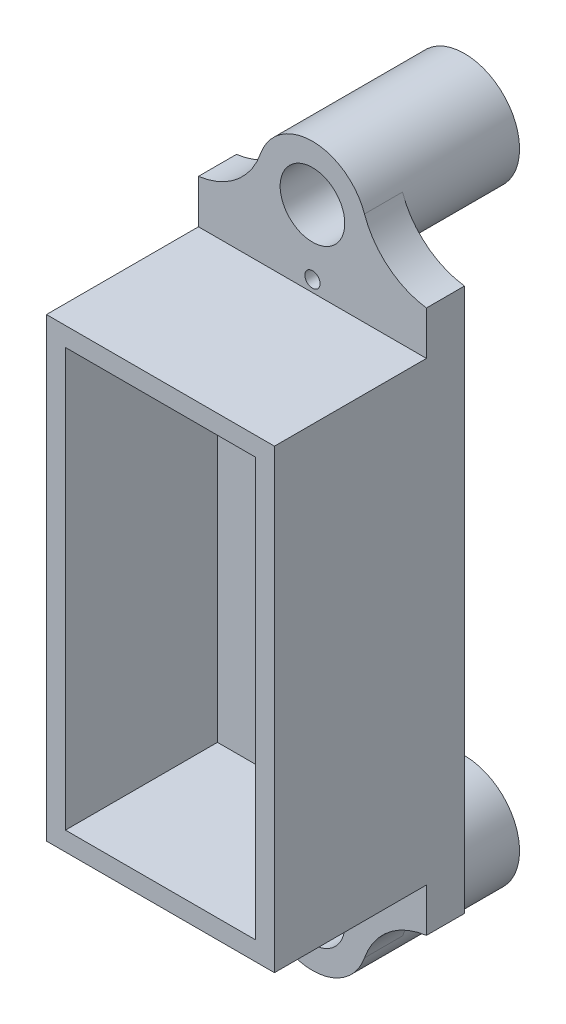
ISO-10303-21;
HEADER;
FILE_DESCRIPTION(('STEP AP214'),'2;1');
FILE_NAME('part.step','',(''),(''),'','','');
FILE_SCHEMA(('AUTOMOTIVE_DESIGN { 1 0 10303 214 1 1 1 1 }'));
ENDSEC;
DATA;
#1=APPLICATION_CONTEXT('core data for automotive mechanical design processes');
#2=APPLICATION_PROTOCOL_DEFINITION('international standard','automotive_design',2000,#1);
#3=PRODUCT_CONTEXT('',#1,'mechanical');
#4=PRODUCT('Part','Part','',(#3));
#5=PRODUCT_RELATED_PRODUCT_CATEGORY('part','',(#4));
#6=PRODUCT_DEFINITION_FORMATION('','',#4);
#7=PRODUCT_DEFINITION_CONTEXT('part definition',#1,'design');
#8=PRODUCT_DEFINITION('design','',#6,#7);
#9=PRODUCT_DEFINITION_SHAPE('','',#8);
#10=(LENGTH_UNIT() NAMED_UNIT(*) SI_UNIT(.MILLI.,.METRE.));
#11=(NAMED_UNIT(*) PLANE_ANGLE_UNIT() SI_UNIT($,.RADIAN.));
#12=(NAMED_UNIT(*) SI_UNIT($,.STERADIAN.) SOLID_ANGLE_UNIT());
#13=UNCERTAINTY_MEASURE_WITH_UNIT(LENGTH_MEASURE(1.E-05),#10,'distance_accuracy_value','');
#14=(GEOMETRIC_REPRESENTATION_CONTEXT(3) GLOBAL_UNCERTAINTY_ASSIGNED_CONTEXT((#13)) GLOBAL_UNIT_ASSIGNED_CONTEXT((#10,
#11,#12)) REPRESENTATION_CONTEXT('',''));
#15=CARTESIAN_POINT('',(0.,0.,0.));
#16=DIRECTION('',(0.,0.,1.));
#17=DIRECTION('',(1.,0.,0.));
#18=AXIS2_PLACEMENT_3D('',#15,#16,#17);
#19=CARTESIAN_POINT('',(0.,40.,20.));
#20=DIRECTION('',(0.,0.,1.));
#21=DIRECTION('',(1.,0.,0.));
#22=AXIS2_PLACEMENT_3D('',#19,#20,#21);
#23=PLANE('',#22);
#24=CARTESIAN_POINT('',(0.,-31.5,20.));
#25=DIRECTION('',(0.,0.,1.));
#26=DIRECTION('',(-1.,0.,0.));
#27=AXIS2_PLACEMENT_3D('',#24,#25,#26);
#28=CIRCLE('',#27,1.);
#29=CARTESIAN_POINT('',(-1.,-31.5,20.));
#30=VERTEX_POINT('',#29);
#31=EDGE_CURVE('E299',#30,#30,#28,.T.);
#32=ORIENTED_EDGE('',*,*,#31,.F.);
#33=EDGE_LOOP('',(#32));
#34=FACE_BOUND('',#33,.T.);
#35=DIRECTION('',(1.,0.,0.));
#36=VECTOR('',#35,1.);
#37=CARTESIAN_POINT('',(-15.,-30.,20.));
#38=LINE('',#37,#36);
#39=CARTESIAN_POINT('',(-15.,-30.,20.));
#40=VERTEX_POINT('',#39);
#41=CARTESIAN_POINT('',(15.,-30.,20.));
#42=VERTEX_POINT('',#41);
#43=EDGE_CURVE('E194',#40,#42,#38,.T.);
#44=ORIENTED_EDGE('',*,*,#43,.F.);
#45=DIRECTION('',(0.,-1.,0.));
#46=VECTOR('',#45,1.);
#47=CARTESIAN_POINT('',(-15.,-35.75,20.));
#48=LINE('',#47,#46);
#49=CARTESIAN_POINT('',(-15.,-35.75,20.));
#50=VERTEX_POINT('',#49);
#51=EDGE_CURVE('E238',#40,#50,#48,.T.);
#52=ORIENTED_EDGE('',*,*,#51,.T.);
#53=CARTESIAN_POINT('',(-16.2928865034887,-45.6660700123132,20.));
#54=DIRECTION('',(0.,0.,1.));
#55=DIRECTION('',(1.,0.,0.));
#56=AXIS2_PLACEMENT_3D('',#53,#54,#55);
#57=CIRCLE('',#56,10.);
#58=CARTESIAN_POINT('',(-6.84773490726338,-42.3813917443055,20.));
#59=VERTEX_POINT('',#58);
#60=EDGE_CURVE('E278',#50,#59,#57,.F.);
#61=ORIENTED_EDGE('',*,*,#60,.T.);
#62=CARTESIAN_POINT('',(0.,-40.,20.));
#63=DIRECTION('',(0.,0.,1.));
#64=DIRECTION('',(-1.,0.,0.));
#65=AXIS2_PLACEMENT_3D('',#62,#63,#64);
#66=CIRCLE('',#65,7.25);
#67=CARTESIAN_POINT('',(6.84773490726338,-42.3813917443055,20.));
#68=VERTEX_POINT('',#67);
#69=EDGE_CURVE('E222',#59,#68,#66,.T.);
#70=ORIENTED_EDGE('',*,*,#69,.T.);
#71=CARTESIAN_POINT('',(16.2928865034887,-45.6660700123132,20.));
#72=DIRECTION('',(0.,0.,1.));
#73=DIRECTION('',(1.,0.,0.));
#74=AXIS2_PLACEMENT_3D('',#71,#72,#73);
#75=CIRCLE('',#74,10.);
#76=CARTESIAN_POINT('',(15.,-35.75,20.));
#77=VERTEX_POINT('',#76);
#78=EDGE_CURVE('E285',#68,#77,#75,.F.);
#79=ORIENTED_EDGE('',*,*,#78,.T.);
#80=DIRECTION('',(0.,1.,0.));
#81=VECTOR('',#80,1.);
#82=CARTESIAN_POINT('',(15.,-35.75,20.));
#83=LINE('',#82,#81);
#84=EDGE_CURVE('E236',#77,#42,#83,.T.);
#85=ORIENTED_EDGE('',*,*,#84,.T.);
#86=EDGE_LOOP('',(#44,#52,#61,#70,#79,#85));
#87=FACE_BOUND('',#86,.T.);
#88=CARTESIAN_POINT('',(0.,-40.,20.));
#89=DIRECTION('',(0.,0.,1.));
#90=DIRECTION('',(-1.,0.,0.));
#91=AXIS2_PLACEMENT_3D('',#88,#89,#90);
#92=CIRCLE('',#91,4.25);
#93=CARTESIAN_POINT('',(-4.25,-40.,20.));
#94=VERTEX_POINT('',#93);
#95=EDGE_CURVE('E216',#94,#94,#92,.T.);
#96=ORIENTED_EDGE('',*,*,#95,.F.);
#97=EDGE_LOOP('',(#96));
#98=FACE_BOUND('',#97,.T.);
#99=ADVANCED_FACE('F33',(#34,#87,#98),#23,.T.);
#100=CARTESIAN_POINT('',(0.,31.5,20.));
#101=DIRECTION('',(0.,0.,1.));
#102=DIRECTION('',(1.,0.,0.));
#103=AXIS2_PLACEMENT_3D('',#100,#101,#102);
#104=CIRCLE('',#103,1.);
#105=CARTESIAN_POINT('',(1.,31.5,20.));
#106=VERTEX_POINT('',#105);
#107=EDGE_CURVE('E292',#106,#106,#104,.T.);
#108=ORIENTED_EDGE('',*,*,#107,.F.);
#109=EDGE_LOOP('',(#108));
#110=FACE_BOUND('',#109,.T.);
#111=DIRECTION('',(-1.,0.,0.));
#112=VECTOR('',#111,1.);
#113=CARTESIAN_POINT('',(-15.,30.,20.));
#114=LINE('',#113,#112);
#115=CARTESIAN_POINT('',(15.,30.,20.));
#116=VERTEX_POINT('',#115);
#117=CARTESIAN_POINT('',(-15.,30.,20.));
#118=VERTEX_POINT('',#117);
#119=EDGE_CURVE('E58',#116,#118,#114,.T.);
#120=ORIENTED_EDGE('',*,*,#119,.F.);
#121=CARTESIAN_POINT('',(15.,35.75,20.));
#122=VERTEX_POINT('',#121);
#123=EDGE_CURVE('E225',#116,#122,#83,.T.);
#124=ORIENTED_EDGE('',*,*,#123,.T.);
#125=CARTESIAN_POINT('',(16.2928865034887,45.6660700123132,20.));
#126=DIRECTION('',(0.,0.,1.));
#127=DIRECTION('',(1.,0.,0.));
#128=AXIS2_PLACEMENT_3D('',#125,#126,#127);
#129=CIRCLE('',#128,10.);
#130=CARTESIAN_POINT('',(6.84773490726338,42.3813917443055,20.));
#131=VERTEX_POINT('',#130);
#132=EDGE_CURVE('E289',#122,#131,#129,.F.);
#133=ORIENTED_EDGE('',*,*,#132,.T.);
#134=CARTESIAN_POINT('',(0.,40.,20.));
#135=DIRECTION('',(0.,0.,1.));
#136=DIRECTION('',(1.,0.,0.));
#137=AXIS2_PLACEMENT_3D('',#134,#135,#136);
#138=CIRCLE('',#137,7.25);
#139=CARTESIAN_POINT('',(-6.84773490726338,42.3813917443055,20.));
#140=VERTEX_POINT('',#139);
#141=EDGE_CURVE('E260',#131,#140,#138,.T.);
#142=ORIENTED_EDGE('',*,*,#141,.T.);
#143=CARTESIAN_POINT('',(-16.2928865034887,45.6660700123132,20.));
#144=DIRECTION('',(0.,0.,1.));
#145=DIRECTION('',(1.,0.,0.));
#146=AXIS2_PLACEMENT_3D('',#143,#144,#145);
#147=CIRCLE('',#146,10.);
#148=CARTESIAN_POINT('',(-15.,35.75,20.));
#149=VERTEX_POINT('',#148);
#150=EDGE_CURVE('E42',#140,#149,#147,.F.);
#151=ORIENTED_EDGE('',*,*,#150,.T.);
#152=EDGE_CURVE('E232',#149,#118,#48,.T.);
#153=ORIENTED_EDGE('',*,*,#152,.T.);
#154=EDGE_LOOP('',(#120,#124,#133,#142,#151,#153));
#155=FACE_BOUND('',#154,.T.);
#156=CARTESIAN_POINT('',(0.,40.,20.));
#157=DIRECTION('',(0.,0.,1.));
#158=DIRECTION('',(1.,0.,0.));
#159=AXIS2_PLACEMENT_3D('',#156,#157,#158);
#160=CIRCLE('',#159,4.25);
#161=CARTESIAN_POINT('',(4.25,40.,20.));
#162=VERTEX_POINT('',#161);
#163=EDGE_CURVE('E254',#162,#162,#160,.T.);
#164=ORIENTED_EDGE('',*,*,#163,.F.);
#165=EDGE_LOOP('',(#164));
#166=FACE_BOUND('',#165,.T.);
#167=ADVANCED_FACE('F308',(#110,#155,#166),#23,.T.);
#168=CARTESIAN_POINT('',(0.,40.,0.));
#169=DIRECTION('',(0.,0.,1.));
#170=DIRECTION('',(1.,0.,0.));
#171=AXIS2_PLACEMENT_3D('',#168,#169,#170);
#172=PLANE('',#171);
#173=CARTESIAN_POINT('',(0.,40.,0.));
#174=DIRECTION('',(0.,0.,1.));
#175=DIRECTION('',(1.,0.,0.));
#176=AXIS2_PLACEMENT_3D('',#173,#174,#175);
#177=CIRCLE('',#176,7.25);
#178=CARTESIAN_POINT('',(7.25,40.,0.));
#179=VERTEX_POINT('',#178);
#180=EDGE_CURVE('E257',#179,#179,#177,.T.);
#181=ORIENTED_EDGE('',*,*,#180,.F.);
#182=EDGE_LOOP('',(#181));
#183=FACE_BOUND('',#182,.T.);
#184=CARTESIAN_POINT('',(0.,40.,0.));
#185=DIRECTION('',(0.,0.,1.));
#186=DIRECTION('',(1.,0.,0.));
#187=AXIS2_PLACEMENT_3D('',#184,#185,#186);
#188=CIRCLE('',#187,4.25);
#189=CARTESIAN_POINT('',(4.25,40.,0.));
#190=VERTEX_POINT('',#189);
#191=EDGE_CURVE('E253',#190,#190,#188,.T.);
#192=ORIENTED_EDGE('',*,*,#191,.T.);
#193=EDGE_LOOP('',(#192));
#194=FACE_BOUND('',#193,.T.);
#195=ADVANCED_FACE('F353',(#183,#194),#172,.F.);
#196=CARTESIAN_POINT('',(0.,40.,20.));
#197=DIRECTION('',(0.,0.,-1.));
#198=DIRECTION('',(-1.,0.,0.));
#199=AXIS2_PLACEMENT_3D('',#196,#197,#198);
#200=CYLINDRICAL_SURFACE('',#199,7.25);
#201=ORIENTED_EDGE('',*,*,#141,.F.);
#202=DIRECTION('',(0.,0.,-1.));
#203=VECTOR('',#202,1.);
#204=CARTESIAN_POINT('',(6.84773490726338,42.3813917443055,20.));
#205=LINE('',#204,#203);
#206=CARTESIAN_POINT('',(6.84773490726338,42.3813917443055,15.));
#207=VERTEX_POINT('',#206);
#208=EDGE_CURVE('E275',#131,#207,#205,.T.);
#209=ORIENTED_EDGE('',*,*,#208,.T.);
#210=CARTESIAN_POINT('',(0.,40.,15.));
#211=DIRECTION('',(0.,0.,-1.));
#212=DIRECTION('',(-1.,0.,0.));
#213=AXIS2_PLACEMENT_3D('',#210,#211,#212);
#214=CIRCLE('',#213,7.25);
#215=CARTESIAN_POINT('',(-6.84773490726338,42.3813917443055,15.));
#216=VERTEX_POINT('',#215);
#217=EDGE_CURVE('E243',#207,#216,#214,.T.);
#218=ORIENTED_EDGE('',*,*,#217,.T.);
#219=DIRECTION('',(0.,0.,-1.));
#220=VECTOR('',#219,1.);
#221=CARTESIAN_POINT('',(-6.84773490726338,42.3813917443055,20.));
#222=LINE('',#221,#220);
#223=EDGE_CURVE('E272',#216,#140,#222,.F.);
#224=ORIENTED_EDGE('',*,*,#223,.T.);
#225=EDGE_LOOP('',(#201,#209,#218,#224));
#226=FACE_BOUND('',#225,.T.);
#227=ORIENTED_EDGE('',*,*,#180,.T.);
#228=EDGE_LOOP('',(#227));
#229=FACE_BOUND('',#228,.T.);
#230=ADVANCED_FACE('F349',(#226,#229),#200,.T.);
#231=CARTESIAN_POINT('',(0.,40.,20.));
#232=DIRECTION('',(0.,0.,-1.));
#233=DIRECTION('',(-1.,0.,0.));
#234=AXIS2_PLACEMENT_3D('',#231,#232,#233);
#235=CYLINDRICAL_SURFACE('',#234,4.25);
#236=ORIENTED_EDGE('',*,*,#163,.T.);
#237=EDGE_LOOP('',(#236));
#238=FACE_BOUND('',#237,.T.);
#239=ORIENTED_EDGE('',*,*,#191,.F.);
#240=EDGE_LOOP('',(#239));
#241=FACE_BOUND('',#240,.T.);
#242=ADVANCED_FACE('F347',(#238,#241),#235,.F.);
#243=CARTESIAN_POINT('',(15.,-35.75,15.));
#244=DIRECTION('',(1.,0.,0.));
#245=DIRECTION('',(0.,0.,-1.));
#246=AXIS2_PLACEMENT_3D('',#243,#244,#245);
#247=PLANE('',#246);
#248=ORIENTED_EDGE('',*,*,#84,.F.);
#249=DIRECTION('',(0.,0.,1.));
#250=VECTOR('',#249,1.);
#251=CARTESIAN_POINT('',(15.,-35.75,15.));
#252=LINE('',#251,#250);
#253=CARTESIAN_POINT('',(15.,-35.75,15.));
#254=VERTEX_POINT('',#253);
#255=EDGE_CURVE('E240',#254,#77,#252,.T.);
#256=ORIENTED_EDGE('',*,*,#255,.F.);
#257=DIRECTION('',(0.,1.,0.));
#258=VECTOR('',#257,1.);
#259=CARTESIAN_POINT('',(15.,-35.75,15.));
#260=LINE('',#259,#258);
#261=CARTESIAN_POINT('',(15.,35.75,15.));
#262=VERTEX_POINT('',#261);
#263=EDGE_CURVE('E228',#254,#262,#260,.T.);
#264=ORIENTED_EDGE('',*,*,#263,.T.);
#265=DIRECTION('',(0.,0.,1.));
#266=VECTOR('',#265,1.);
#267=CARTESIAN_POINT('',(15.,35.75,15.));
#268=LINE('',#267,#266);
#269=EDGE_CURVE('E235',#262,#122,#268,.T.);
#270=ORIENTED_EDGE('',*,*,#269,.T.);
#271=ORIENTED_EDGE('',*,*,#123,.F.);
#272=DIRECTION('',(0.,0.,-1.));
#273=VECTOR('',#272,1.);
#274=CARTESIAN_POINT('',(15.,30.,40.));
#275=LINE('',#274,#273);
#276=CARTESIAN_POINT('',(15.,30.,40.));
#277=VERTEX_POINT('',#276);
#278=EDGE_CURVE('E212',#277,#116,#275,.T.);
#279=ORIENTED_EDGE('',*,*,#278,.F.);
#280=DIRECTION('',(0.,1.,0.));
#281=VECTOR('',#280,1.);
#282=CARTESIAN_POINT('',(15.,-30.,40.));
#283=LINE('',#282,#281);
#284=CARTESIAN_POINT('',(15.,-30.,40.));
#285=VERTEX_POINT('',#284);
#286=EDGE_CURVE('E190',#285,#277,#283,.T.);
#287=ORIENTED_EDGE('',*,*,#286,.F.);
#288=DIRECTION('',(0.,0.,-1.));
#289=VECTOR('',#288,1.);
#290=CARTESIAN_POINT('',(15.,-30.,40.));
#291=LINE('',#290,#289);
#292=EDGE_CURVE('E200',#285,#42,#291,.T.);
#293=ORIENTED_EDGE('',*,*,#292,.T.);
#294=EDGE_LOOP('',(#248,#256,#264,#270,#271,#279,#287,#293));
#295=FACE_BOUND('',#294,.T.);
#296=ADVANCED_FACE('F343',(#295),#247,.T.);
#297=CARTESIAN_POINT('',(-15.,-35.75,15.));
#298=DIRECTION('',(-1.,0.,0.));
#299=DIRECTION('',(0.,0.,1.));
#300=AXIS2_PLACEMENT_3D('',#297,#298,#299);
#301=PLANE('',#300);
#302=ORIENTED_EDGE('',*,*,#152,.F.);
#303=DIRECTION('',(0.,0.,1.));
#304=VECTOR('',#303,1.);
#305=CARTESIAN_POINT('',(-15.,35.75,15.));
#306=LINE('',#305,#304);
#307=CARTESIAN_POINT('',(-15.,35.75,15.));
#308=VERTEX_POINT('',#307);
#309=EDGE_CURVE('E247',#308,#149,#306,.T.);
#310=ORIENTED_EDGE('',*,*,#309,.F.);
#311=DIRECTION('',(0.,-1.,0.));
#312=VECTOR('',#311,1.);
#313=CARTESIAN_POINT('',(-15.,-35.75,15.));
#314=LINE('',#313,#312);
#315=CARTESIAN_POINT('',(-15.,-35.75,15.));
#316=VERTEX_POINT('',#315);
#317=EDGE_CURVE('E231',#308,#316,#314,.T.);
#318=ORIENTED_EDGE('',*,*,#317,.T.);
#319=DIRECTION('',(0.,0.,1.));
#320=VECTOR('',#319,1.);
#321=CARTESIAN_POINT('',(-15.,-35.75,15.));
#322=LINE('',#321,#320);
#323=EDGE_CURVE('E244',#316,#50,#322,.T.);
#324=ORIENTED_EDGE('',*,*,#323,.T.);
#325=ORIENTED_EDGE('',*,*,#51,.F.);
#326=DIRECTION('',(0.,0.,-1.));
#327=VECTOR('',#326,1.);
#328=CARTESIAN_POINT('',(-15.,-30.,40.));
#329=LINE('',#328,#327);
#330=CARTESIAN_POINT('',(-15.,-30.,40.));
#331=VERTEX_POINT('',#330);
#332=EDGE_CURVE('E206',#331,#40,#329,.T.);
#333=ORIENTED_EDGE('',*,*,#332,.F.);
#334=DIRECTION('',(0.,-1.,0.));
#335=VECTOR('',#334,1.);
#336=CARTESIAN_POINT('',(-15.,-30.,40.));
#337=LINE('',#336,#335);
#338=CARTESIAN_POINT('',(-15.,30.,40.));
#339=VERTEX_POINT('',#338);
#340=EDGE_CURVE('E196',#339,#331,#337,.T.);
#341=ORIENTED_EDGE('',*,*,#340,.F.);
#342=DIRECTION('',(0.,0.,-1.));
#343=VECTOR('',#342,1.);
#344=CARTESIAN_POINT('',(-15.,30.,40.));
#345=LINE('',#344,#343);
#346=EDGE_CURVE('E209',#339,#118,#345,.T.);
#347=ORIENTED_EDGE('',*,*,#346,.T.);
#348=EDGE_LOOP('',(#302,#310,#318,#324,#325,#333,#341,#347));
#349=FACE_BOUND('',#348,.T.);
#350=ADVANCED_FACE('F335',(#349),#301,.T.);
#351=CARTESIAN_POINT('',(0.,0.,15.));
#352=DIRECTION('',(0.,0.,-1.));
#353=DIRECTION('',(-1.,0.,0.));
#354=AXIS2_PLACEMENT_3D('',#351,#352,#353);
#355=PLANE('',#354);
#356=CARTESIAN_POINT('',(0.,-31.5,15.));
#357=DIRECTION('',(0.,0.,-1.));
#358=DIRECTION('',(-1.,0.,0.));
#359=AXIS2_PLACEMENT_3D('',#356,#357,#358);
#360=CIRCLE('',#359,1.);
#361=CARTESIAN_POINT('',(-1.,-31.5,15.));
#362=VERTEX_POINT('',#361);
#363=EDGE_CURVE('E37',#362,#362,#360,.T.);
#364=ORIENTED_EDGE('',*,*,#363,.F.);
#365=EDGE_LOOP('',(#364));
#366=FACE_BOUND('',#365,.T.);
#367=CARTESIAN_POINT('',(0.,31.5,15.));
#368=DIRECTION('',(0.,0.,-1.));
#369=DIRECTION('',(-1.,0.,0.));
#370=AXIS2_PLACEMENT_3D('',#367,#368,#369);
#371=CIRCLE('',#370,1.);
#372=CARTESIAN_POINT('',(-1.,31.5,15.));
#373=VERTEX_POINT('',#372);
#374=EDGE_CURVE('E180',#373,#373,#371,.T.);
#375=ORIENTED_EDGE('',*,*,#374,.F.);
#376=EDGE_LOOP('',(#375));
#377=FACE_BOUND('',#376,.T.);
#378=ORIENTED_EDGE('',*,*,#263,.F.);
#379=CARTESIAN_POINT('',(16.2928865034887,-45.6660700123132,15.));
#380=DIRECTION('',(0.,0.,-1.));
#381=DIRECTION('',(-1.,0.,0.));
#382=AXIS2_PLACEMENT_3D('',#379,#380,#381);
#383=CIRCLE('',#382,10.);
#384=CARTESIAN_POINT('',(6.84773490726338,-42.3813917443055,15.));
#385=VERTEX_POINT('',#384);
#386=EDGE_CURVE('E282',#254,#385,#383,.F.);
#387=ORIENTED_EDGE('',*,*,#386,.T.);
#388=CARTESIAN_POINT('',(0.,-40.,15.));
#389=DIRECTION('',(0.,0.,-1.));
#390=DIRECTION('',(-1.,0.,0.));
#391=AXIS2_PLACEMENT_3D('',#388,#389,#390);
#392=CIRCLE('',#391,7.25);
#393=CARTESIAN_POINT('',(-6.84773490726338,-42.3813917443055,15.));
#394=VERTEX_POINT('',#393);
#395=EDGE_CURVE('E263',#385,#394,#392,.F.);
#396=ORIENTED_EDGE('',*,*,#395,.T.);
#397=CARTESIAN_POINT('',(-16.2928865034887,-45.6660700123132,15.));
#398=DIRECTION('',(0.,0.,-1.));
#399=DIRECTION('',(-1.,0.,0.));
#400=AXIS2_PLACEMENT_3D('',#397,#398,#399);
#401=CIRCLE('',#400,10.);
#402=EDGE_CURVE('E280',#394,#316,#401,.F.);
#403=ORIENTED_EDGE('',*,*,#402,.T.);
#404=ORIENTED_EDGE('',*,*,#317,.F.);
#405=CARTESIAN_POINT('',(-16.2928865034887,45.6660700123132,15.));
#406=DIRECTION('',(0.,0.,-1.));
#407=DIRECTION('',(-1.,0.,0.));
#408=AXIS2_PLACEMENT_3D('',#405,#406,#407);
#409=CIRCLE('',#408,10.);
#410=EDGE_CURVE('E11',#308,#216,#409,.F.);
#411=ORIENTED_EDGE('',*,*,#410,.T.);
#412=ORIENTED_EDGE('',*,*,#217,.F.);
#413=CARTESIAN_POINT('',(16.2928865034887,45.6660700123132,15.));
#414=DIRECTION('',(0.,0.,-1.));
#415=DIRECTION('',(-1.,0.,0.));
#416=AXIS2_PLACEMENT_3D('',#413,#414,#415);
#417=CIRCLE('',#416,10.);
#418=EDGE_CURVE('E287',#207,#262,#417,.F.);
#419=ORIENTED_EDGE('',*,*,#418,.T.);
#420=EDGE_LOOP('',(#378,#387,#396,#403,#404,#411,#412,#419));
#421=FACE_BOUND('',#420,.T.);
#422=ADVANCED_FACE('F325',(#366,#377,#421),#355,.T.);
#423=CARTESIAN_POINT('',(0.,-40.,0.));
#424=DIRECTION('',(0.,0.,-1.));
#425=DIRECTION('',(-1.,0.,0.));
#426=AXIS2_PLACEMENT_3D('',#423,#424,#425);
#427=PLANE('',#426);
#428=CARTESIAN_POINT('',(0.,-40.,0.));
#429=DIRECTION('',(0.,0.,1.));
#430=DIRECTION('',(-1.,0.,0.));
#431=AXIS2_PLACEMENT_3D('',#428,#429,#430);
#432=CIRCLE('',#431,7.25);
#433=CARTESIAN_POINT('',(-7.25,-40.,0.));
#434=VERTEX_POINT('',#433);
#435=EDGE_CURVE('E219',#434,#434,#432,.T.);
#436=ORIENTED_EDGE('',*,*,#435,.F.);
#437=EDGE_LOOP('',(#436));
#438=FACE_BOUND('',#437,.T.);
#439=CARTESIAN_POINT('',(0.,-40.,0.));
#440=DIRECTION('',(0.,0.,1.));
#441=DIRECTION('',(-1.,0.,0.));
#442=AXIS2_PLACEMENT_3D('',#439,#440,#441);
#443=CIRCLE('',#442,4.25);
#444=CARTESIAN_POINT('',(-4.25,-40.,0.));
#445=VERTEX_POINT('',#444);
#446=EDGE_CURVE('E215',#445,#445,#443,.T.);
#447=ORIENTED_EDGE('',*,*,#446,.T.);
#448=EDGE_LOOP('',(#447));
#449=FACE_BOUND('',#448,.T.);
#450=ADVANCED_FACE('F323',(#438,#449),#427,.T.);
#451=CARTESIAN_POINT('',(0.,-40.,20.));
#452=DIRECTION('',(0.,0.,-1.));
#453=DIRECTION('',(-1.,0.,0.));
#454=AXIS2_PLACEMENT_3D('',#451,#452,#453);
#455=CYLINDRICAL_SURFACE('',#454,7.25);
#456=ORIENTED_EDGE('',*,*,#69,.F.);
#457=DIRECTION('',(0.,0.,-1.));
#458=VECTOR('',#457,1.);
#459=CARTESIAN_POINT('',(-6.84773490726338,-42.3813917443055,20.));
#460=LINE('',#459,#458);
#461=EDGE_CURVE('E269',#59,#394,#460,.T.);
#462=ORIENTED_EDGE('',*,*,#461,.T.);
#463=ORIENTED_EDGE('',*,*,#395,.F.);
#464=DIRECTION('',(0.,0.,-1.));
#465=VECTOR('',#464,1.);
#466=CARTESIAN_POINT('',(6.84773490726339,-42.3813917443055,20.));
#467=LINE('',#466,#465);
#468=EDGE_CURVE('E267',#385,#68,#467,.F.);
#469=ORIENTED_EDGE('',*,*,#468,.T.);
#470=EDGE_LOOP('',(#456,#462,#463,#469));
#471=FACE_BOUND('',#470,.T.);
#472=ORIENTED_EDGE('',*,*,#435,.T.);
#473=EDGE_LOOP('',(#472));
#474=FACE_BOUND('',#473,.T.);
#475=ADVANCED_FACE('F319',(#471,#474),#455,.T.);
#476=CARTESIAN_POINT('',(0.,-40.,20.));
#477=DIRECTION('',(0.,0.,-1.));
#478=DIRECTION('',(-1.,0.,0.));
#479=AXIS2_PLACEMENT_3D('',#476,#477,#478);
#480=CYLINDRICAL_SURFACE('',#479,4.25);
#481=ORIENTED_EDGE('',*,*,#95,.T.);
#482=EDGE_LOOP('',(#481));
#483=FACE_BOUND('',#482,.T.);
#484=ORIENTED_EDGE('',*,*,#446,.F.);
#485=EDGE_LOOP('',(#484));
#486=FACE_BOUND('',#485,.T.);
#487=ADVANCED_FACE('F315',(#483,#486),#480,.F.);
#488=CARTESIAN_POINT('',(-16.2928865034887,-45.6660700123132,20.));
#489=DIRECTION('',(0.,0.,-1.));
#490=DIRECTION('',(-1.,0.,0.));
#491=AXIS2_PLACEMENT_3D('',#488,#489,#490);
#492=CYLINDRICAL_SURFACE('',#491,10.);
#493=ORIENTED_EDGE('',*,*,#402,.F.);
#494=ORIENTED_EDGE('',*,*,#461,.F.);
#495=ORIENTED_EDGE('',*,*,#60,.F.);
#496=ORIENTED_EDGE('',*,*,#323,.F.);
#497=EDGE_LOOP('',(#493,#494,#495,#496));
#498=FACE_BOUND('',#497,.T.);
#499=ADVANCED_FACE('F318',(#498),#492,.F.);
#500=CARTESIAN_POINT('',(16.2928865034887,-45.6660700123132,20.));
#501=DIRECTION('',(0.,0.,1.));
#502=DIRECTION('',(1.,0.,0.));
#503=AXIS2_PLACEMENT_3D('',#500,#501,#502);
#504=CYLINDRICAL_SURFACE('',#503,10.);
#505=ORIENTED_EDGE('',*,*,#78,.F.);
#506=ORIENTED_EDGE('',*,*,#468,.F.);
#507=ORIENTED_EDGE('',*,*,#386,.F.);
#508=ORIENTED_EDGE('',*,*,#255,.T.);
#509=EDGE_LOOP('',(#505,#506,#507,#508));
#510=FACE_BOUND('',#509,.T.);
#511=ADVANCED_FACE('F363',(#510),#504,.F.);
#512=CARTESIAN_POINT('',(16.2928865034887,45.6660700123132,15.));
#513=DIRECTION('',(0.,0.,1.));
#514=DIRECTION('',(1.,0.,0.));
#515=AXIS2_PLACEMENT_3D('',#512,#513,#514);
#516=CYLINDRICAL_SURFACE('',#515,10.);
#517=ORIENTED_EDGE('',*,*,#132,.F.);
#518=ORIENTED_EDGE('',*,*,#269,.F.);
#519=ORIENTED_EDGE('',*,*,#418,.F.);
#520=ORIENTED_EDGE('',*,*,#208,.F.);
#521=EDGE_LOOP('',(#517,#518,#519,#520));
#522=FACE_BOUND('',#521,.T.);
#523=ADVANCED_FACE('F366',(#522),#516,.F.);
#524=CARTESIAN_POINT('',(-16.2928865034887,45.6660700123132,15.));
#525=DIRECTION('',(0.,0.,-1.));
#526=DIRECTION('',(-1.,0.,0.));
#527=AXIS2_PLACEMENT_3D('',#524,#525,#526);
#528=CYLINDRICAL_SURFACE('',#527,10.);
#529=ORIENTED_EDGE('',*,*,#410,.F.);
#530=ORIENTED_EDGE('',*,*,#309,.T.);
#531=ORIENTED_EDGE('',*,*,#150,.F.);
#532=ORIENTED_EDGE('',*,*,#223,.F.);
#533=EDGE_LOOP('',(#529,#530,#531,#532));
#534=FACE_BOUND('',#533,.T.);
#535=ADVANCED_FACE('F35',(#534),#528,.F.);
#536=CARTESIAN_POINT('',(0.,0.,40.));
#537=DIRECTION('',(0.,0.,-1.));
#538=DIRECTION('',(-1.,0.,0.));
#539=AXIS2_PLACEMENT_3D('',#536,#537,#538);
#540=PLANE('',#539);
#541=ORIENTED_EDGE('',*,*,#286,.T.);
#542=DIRECTION('',(-1.,0.,0.));
#543=VECTOR('',#542,1.);
#544=CARTESIAN_POINT('',(-15.,30.,40.));
#545=LINE('',#544,#543);
#546=EDGE_CURVE('E193',#277,#339,#545,.T.);
#547=ORIENTED_EDGE('',*,*,#546,.T.);
#548=ORIENTED_EDGE('',*,*,#340,.T.);
#549=DIRECTION('',(1.,0.,0.));
#550=VECTOR('',#549,1.);
#551=CARTESIAN_POINT('',(-15.,-30.,40.));
#552=LINE('',#551,#550);
#553=EDGE_CURVE('E198',#331,#285,#552,.T.);
#554=ORIENTED_EDGE('',*,*,#553,.T.);
#555=EDGE_LOOP('',(#541,#547,#548,#554));
#556=FACE_BOUND('',#555,.T.);
#557=DIRECTION('',(0.,-1.,0.));
#558=VECTOR('',#557,1.);
#559=CARTESIAN_POINT('',(-12.5,-27.5,40.));
#560=LINE('',#559,#558);
#561=CARTESIAN_POINT('',(-12.5,27.5,40.));
#562=VERTEX_POINT('',#561);
#563=CARTESIAN_POINT('',(-12.5,-27.5,40.));
#564=VERTEX_POINT('',#563);
#565=EDGE_CURVE('E150',#562,#564,#560,.T.);
#566=ORIENTED_EDGE('',*,*,#565,.F.);
#567=DIRECTION('',(-1.,0.,0.));
#568=VECTOR('',#567,1.);
#569=CARTESIAN_POINT('',(-12.5,27.5,40.));
#570=LINE('',#569,#568);
#571=CARTESIAN_POINT('',(12.5,27.5,40.));
#572=VERTEX_POINT('',#571);
#573=EDGE_CURVE('E173',#572,#562,#570,.T.);
#574=ORIENTED_EDGE('',*,*,#573,.F.);
#575=DIRECTION('',(0.,1.,0.));
#576=VECTOR('',#575,1.);
#577=CARTESIAN_POINT('',(12.5,-27.5,40.));
#578=LINE('',#577,#576);
#579=CARTESIAN_POINT('',(12.5,-27.5,40.));
#580=VERTEX_POINT('',#579);
#581=EDGE_CURVE('E171',#580,#572,#578,.T.);
#582=ORIENTED_EDGE('',*,*,#581,.F.);
#583=DIRECTION('',(1.,0.,0.));
#584=VECTOR('',#583,1.);
#585=CARTESIAN_POINT('',(-12.5,-27.5,40.));
#586=LINE('',#585,#584);
#587=EDGE_CURVE('E159',#564,#580,#586,.T.);
#588=ORIENTED_EDGE('',*,*,#587,.F.);
#589=EDGE_LOOP('',(#566,#574,#582,#588));
#590=FACE_BOUND('',#589,.T.);
#591=ADVANCED_FACE('F169',(#556,#590),#540,.F.);
#592=CARTESIAN_POINT('',(-15.,30.,40.));
#593=DIRECTION('',(0.,-1.,0.));
#594=DIRECTION('',(0.,0.,-1.));
#595=AXIS2_PLACEMENT_3D('',#592,#593,#594);
#596=PLANE('',#595);
#597=ORIENTED_EDGE('',*,*,#119,.T.);
#598=ORIENTED_EDGE('',*,*,#346,.F.);
#599=ORIENTED_EDGE('',*,*,#546,.F.);
#600=ORIENTED_EDGE('',*,*,#278,.T.);
#601=EDGE_LOOP('',(#597,#598,#599,#600));
#602=FACE_BOUND('',#601,.T.);
#603=ADVANCED_FACE('F389',(#602),#596,.F.);
#604=CARTESIAN_POINT('',(-15.,-30.,40.));
#605=DIRECTION('',(0.,1.,0.));
#606=DIRECTION('',(0.,0.,1.));
#607=AXIS2_PLACEMENT_3D('',#604,#605,#606);
#608=PLANE('',#607);
#609=ORIENTED_EDGE('',*,*,#43,.T.);
#610=ORIENTED_EDGE('',*,*,#292,.F.);
#611=ORIENTED_EDGE('',*,*,#553,.F.);
#612=ORIENTED_EDGE('',*,*,#332,.T.);
#613=EDGE_LOOP('',(#609,#610,#611,#612));
#614=FACE_BOUND('',#613,.T.);
#615=ADVANCED_FACE('F407',(#614),#608,.F.);
#616=CARTESIAN_POINT('',(-12.5,-27.5,40.));
#617=DIRECTION('',(1.,0.,0.));
#618=DIRECTION('',(0.,0.,-1.));
#619=AXIS2_PLACEMENT_3D('',#616,#617,#618);
#620=PLANE('',#619);
#621=DIRECTION('',(0.,-1.,0.));
#622=VECTOR('',#621,1.);
#623=CARTESIAN_POINT('',(-12.5,-27.5,20.));
#624=LINE('',#623,#622);
#625=CARTESIAN_POINT('',(-12.5,27.5,20.));
#626=VERTEX_POINT('',#625);
#627=CARTESIAN_POINT('',(-12.5,-27.5,20.));
#628=VERTEX_POINT('',#627);
#629=EDGE_CURVE('E178',#626,#628,#624,.T.);
#630=ORIENTED_EDGE('',*,*,#629,.F.);
#631=DIRECTION('',(0.,0.,-1.));
#632=VECTOR('',#631,1.);
#633=CARTESIAN_POINT('',(-12.5,27.5,40.));
#634=LINE('',#633,#632);
#635=EDGE_CURVE('E155',#562,#626,#634,.T.);
#636=ORIENTED_EDGE('',*,*,#635,.F.);
#637=ORIENTED_EDGE('',*,*,#565,.T.);
#638=DIRECTION('',(0.,0.,-1.));
#639=VECTOR('',#638,1.);
#640=CARTESIAN_POINT('',(-12.5,-27.5,40.));
#641=LINE('',#640,#639);
#642=EDGE_CURVE('E153',#564,#628,#641,.T.);
#643=ORIENTED_EDGE('',*,*,#642,.T.);
#644=EDGE_LOOP('',(#630,#636,#637,#643));
#645=FACE_BOUND('',#644,.T.);
#646=ADVANCED_FACE('F152',(#645),#620,.T.);
#647=CARTESIAN_POINT('',(-12.5,-27.5,40.));
#648=DIRECTION('',(0.,1.,0.));
#649=DIRECTION('',(0.,0.,1.));
#650=AXIS2_PLACEMENT_3D('',#647,#648,#649);
#651=PLANE('',#650);
#652=DIRECTION('',(1.,0.,0.));
#653=VECTOR('',#652,1.);
#654=CARTESIAN_POINT('',(-12.5,-27.5,20.));
#655=LINE('',#654,#653);
#656=CARTESIAN_POINT('',(12.5,-27.5,20.));
#657=VERTEX_POINT('',#656);
#658=EDGE_CURVE('E165',#628,#657,#655,.T.);
#659=ORIENTED_EDGE('',*,*,#658,.F.);
#660=ORIENTED_EDGE('',*,*,#642,.F.);
#661=ORIENTED_EDGE('',*,*,#587,.T.);
#662=DIRECTION('',(0.,0.,-1.));
#663=VECTOR('',#662,1.);
#664=CARTESIAN_POINT('',(12.5,-27.5,40.));
#665=LINE('',#664,#663);
#666=EDGE_CURVE('E166',#580,#657,#665,.T.);
#667=ORIENTED_EDGE('',*,*,#666,.T.);
#668=EDGE_LOOP('',(#659,#660,#661,#667));
#669=FACE_BOUND('',#668,.T.);
#670=ADVANCED_FACE('F162',(#669),#651,.T.);
#671=CARTESIAN_POINT('',(12.5,-27.5,40.));
#672=DIRECTION('',(-1.,0.,0.));
#673=DIRECTION('',(0.,-1.,0.));
#674=AXIS2_PLACEMENT_3D('',#671,#672,#673);
#675=PLANE('',#674);
#676=DIRECTION('',(0.,1.,0.));
#677=VECTOR('',#676,1.);
#678=CARTESIAN_POINT('',(12.5,-27.5,20.));
#679=LINE('',#678,#677);
#680=CARTESIAN_POINT('',(12.5,27.5,20.));
#681=VERTEX_POINT('',#680);
#682=EDGE_CURVE('E182',#657,#681,#679,.T.);
#683=ORIENTED_EDGE('',*,*,#682,.F.);
#684=ORIENTED_EDGE('',*,*,#666,.F.);
#685=ORIENTED_EDGE('',*,*,#581,.T.);
#686=DIRECTION('',(0.,0.,-1.));
#687=VECTOR('',#686,1.);
#688=CARTESIAN_POINT('',(12.5,27.5,40.));
#689=LINE('',#688,#687);
#690=EDGE_CURVE('E187',#572,#681,#689,.T.);
#691=ORIENTED_EDGE('',*,*,#690,.T.);
#692=EDGE_LOOP('',(#683,#684,#685,#691));
#693=FACE_BOUND('',#692,.T.);
#694=ADVANCED_FACE('F424',(#693),#675,.T.);
#695=CARTESIAN_POINT('',(-12.5,27.5,40.));
#696=DIRECTION('',(0.,-1.,0.));
#697=DIRECTION('',(0.,0.,-1.));
#698=AXIS2_PLACEMENT_3D('',#695,#696,#697);
#699=PLANE('',#698);
#700=DIRECTION('',(-1.,0.,0.));
#701=VECTOR('',#700,1.);
#702=CARTESIAN_POINT('',(-12.5,27.5,20.));
#703=LINE('',#702,#701);
#704=EDGE_CURVE('E50',#681,#626,#703,.T.);
#705=ORIENTED_EDGE('',*,*,#704,.F.);
#706=ORIENTED_EDGE('',*,*,#690,.F.);
#707=ORIENTED_EDGE('',*,*,#573,.T.);
#708=ORIENTED_EDGE('',*,*,#635,.T.);
#709=EDGE_LOOP('',(#705,#706,#707,#708));
#710=FACE_BOUND('',#709,.T.);
#711=ADVANCED_FACE('F428',(#710),#699,.T.);
#712=ORIENTED_EDGE('',*,*,#682,.T.);
#713=ORIENTED_EDGE('',*,*,#704,.T.);
#714=ORIENTED_EDGE('',*,*,#629,.T.);
#715=ORIENTED_EDGE('',*,*,#658,.T.);
#716=EDGE_LOOP('',(#712,#713,#714,#715));
#717=FACE_BOUND('',#716,.T.);
#718=ADVANCED_FACE('F310',(#717),#23,.T.);
#719=CARTESIAN_POINT('',(0.,31.5,0.));
#720=DIRECTION('',(0.,0.,1.));
#721=DIRECTION('',(1.,0.,0.));
#722=AXIS2_PLACEMENT_3D('',#719,#720,#721);
#723=CYLINDRICAL_SURFACE('',#722,1.);
#724=ORIENTED_EDGE('',*,*,#374,.T.);
#725=EDGE_LOOP('',(#724));
#726=FACE_BOUND('',#725,.T.);
#727=ORIENTED_EDGE('',*,*,#107,.T.);
#728=EDGE_LOOP('',(#727));
#729=FACE_BOUND('',#728,.T.);
#730=ADVANCED_FACE('F434',(#726,#729),#723,.F.);
#731=CARTESIAN_POINT('',(0.,-31.5,0.));
#732=DIRECTION('',(0.,0.,1.));
#733=DIRECTION('',(1.,0.,0.));
#734=AXIS2_PLACEMENT_3D('',#731,#732,#733);
#735=CYLINDRICAL_SURFACE('',#734,1.);
#736=ORIENTED_EDGE('',*,*,#363,.T.);
#737=EDGE_LOOP('',(#736));
#738=FACE_BOUND('',#737,.T.);
#739=ORIENTED_EDGE('',*,*,#31,.T.);
#740=EDGE_LOOP('',(#739));
#741=FACE_BOUND('',#740,.T.);
#742=ADVANCED_FACE('F304',(#738,#741),#735,.F.);
#743=CLOSED_SHELL('',(#99,#167,#195,#230,#242,#296,#350,#422,#450,#475,#487,#499,#511,#523,#535,
#591,#603,#615,#646,#670,#694,#711,#718,#730,#742));
#744=MANIFOLD_SOLID_BREP('B2',#743);
#745=ADVANCED_BREP_SHAPE_REPRESENTATION('',(#18,#744),#14);
#746=SHAPE_DEFINITION_REPRESENTATION(#9,#745);
ENDSEC;
END-ISO-10303-21;
